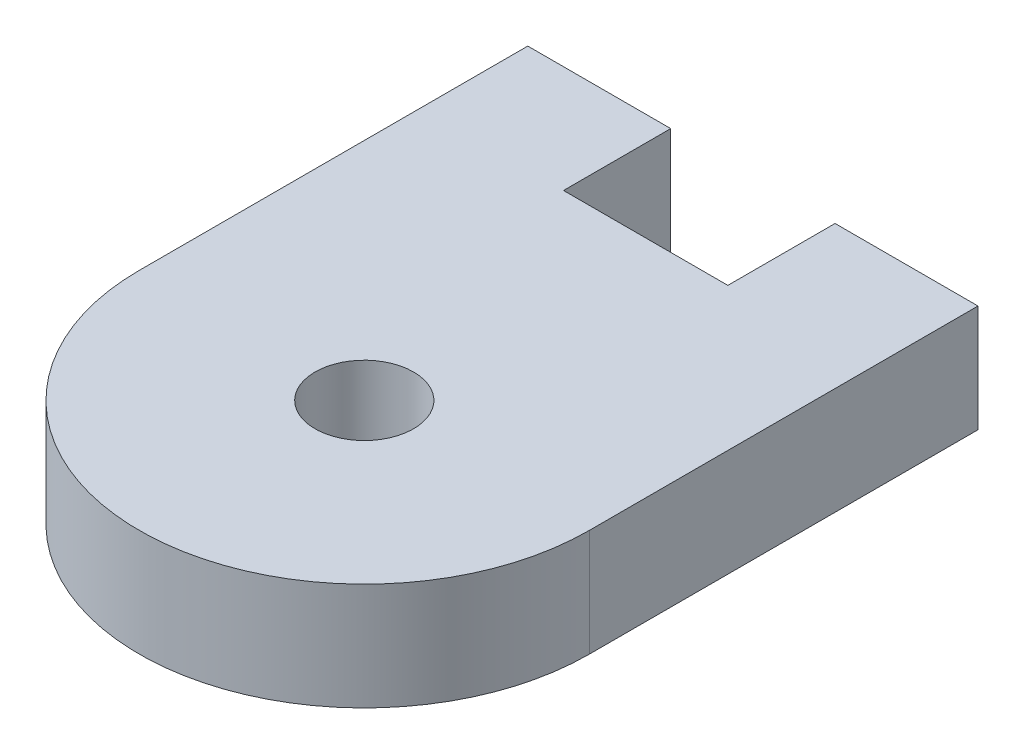
ISO-10303-21;
HEADER;
FILE_DESCRIPTION(('STEP AP214'),'2;1');
FILE_NAME('part.step','',(''),(''),'','','');
FILE_SCHEMA(('AUTOMOTIVE_DESIGN { 1 0 10303 214 1 1 1 1 }'));
ENDSEC;
DATA;
#1=APPLICATION_CONTEXT('core data for automotive mechanical design processes');
#2=APPLICATION_PROTOCOL_DEFINITION('international standard','automotive_design',2000,#1);
#3=PRODUCT_CONTEXT('',#1,'mechanical');
#4=PRODUCT('Part','Part','',(#3));
#5=PRODUCT_RELATED_PRODUCT_CATEGORY('part','',(#4));
#6=PRODUCT_DEFINITION_FORMATION('','',#4);
#7=PRODUCT_DEFINITION_CONTEXT('part definition',#1,'design');
#8=PRODUCT_DEFINITION('design','',#6,#7);
#9=PRODUCT_DEFINITION_SHAPE('','',#8);
#10=(LENGTH_UNIT() NAMED_UNIT(*) SI_UNIT(.MILLI.,.METRE.));
#11=(NAMED_UNIT(*) PLANE_ANGLE_UNIT() SI_UNIT($,.RADIAN.));
#12=(NAMED_UNIT(*) SI_UNIT($,.STERADIAN.) SOLID_ANGLE_UNIT());
#13=UNCERTAINTY_MEASURE_WITH_UNIT(LENGTH_MEASURE(1.E-05),#10,'distance_accuracy_value','');
#14=(GEOMETRIC_REPRESENTATION_CONTEXT(3) GLOBAL_UNCERTAINTY_ASSIGNED_CONTEXT((#13)) GLOBAL_UNIT_ASSIGNED_CONTEXT((#10,
#11,#12)) REPRESENTATION_CONTEXT('',''));
#15=CARTESIAN_POINT('',(0.,0.,0.));
#16=DIRECTION('',(0.,0.,1.));
#17=DIRECTION('',(1.,0.,0.));
#18=AXIS2_PLACEMENT_3D('',#15,#16,#17);
#19=CARTESIAN_POINT('',(0.,7.62,-20.));
#20=DIRECTION('',(0.,0.,-1.));
#21=DIRECTION('',(-1.,0.,0.));
#22=AXIS2_PLACEMENT_3D('',#19,#20,#21);
#23=PLANE('',#22);
#24=DIRECTION('',(1.,0.,0.));
#25=VECTOR('',#24,1.);
#26=CARTESIAN_POINT('',(0.,0.,-20.));
#27=LINE('',#26,#25);
#28=CARTESIAN_POINT('',(10.16,0.,-20.));
#29=VERTEX_POINT('',#28);
#30=CARTESIAN_POINT('',(21.84,0.,-20.));
#31=VERTEX_POINT('',#30);
#32=EDGE_CURVE('E53',#29,#31,#27,.T.);
#33=ORIENTED_EDGE('',*,*,#32,.F.);
#34=DIRECTION('',(0.,-1.,0.));
#35=VECTOR('',#34,1.);
#36=CARTESIAN_POINT('',(10.16,7.62,-20.));
#37=LINE('',#36,#35);
#38=CARTESIAN_POINT('',(10.16,7.62,-20.));
#39=VERTEX_POINT('',#38);
#40=EDGE_CURVE('E122',#39,#29,#37,.T.);
#41=ORIENTED_EDGE('',*,*,#40,.F.);
#42=DIRECTION('',(1.,0.,0.));
#43=VECTOR('',#42,1.);
#44=CARTESIAN_POINT('',(0.,7.62,-20.));
#45=LINE('',#44,#43);
#46=CARTESIAN_POINT('',(21.84,7.62,-20.));
#47=VERTEX_POINT('',#46);
#48=EDGE_CURVE('E108',#39,#47,#45,.T.);
#49=ORIENTED_EDGE('',*,*,#48,.T.);
#50=DIRECTION('',(0.,1.,0.));
#51=VECTOR('',#50,1.);
#52=CARTESIAN_POINT('',(21.84,7.62,-20.));
#53=LINE('',#52,#51);
#54=EDGE_CURVE('E130',#31,#47,#53,.T.);
#55=ORIENTED_EDGE('',*,*,#54,.F.);
#56=EDGE_LOOP('',(#33,#41,#49,#55));
#57=FACE_BOUND('',#56,.T.);
#58=ADVANCED_FACE('F33',(#57),#23,.T.);
#59=CARTESIAN_POINT('',(16.,7.62,0.));
#60=DIRECTION('',(0.,-1.,0.));
#61=DIRECTION('',(0.,0.,-1.));
#62=AXIS2_PLACEMENT_3D('',#59,#60,#61);
#63=CYLINDRICAL_SURFACE('',#62,16.);
#64=CARTESIAN_POINT('',(16.,0.,0.));
#65=DIRECTION('',(0.,1.,0.));
#66=DIRECTION('',(0.,0.,1.));
#67=AXIS2_PLACEMENT_3D('',#64,#65,#66);
#68=CIRCLE('',#67,16.);
#69=CARTESIAN_POINT('',(0.,0.,0.));
#70=VERTEX_POINT('',#69);
#71=CARTESIAN_POINT('',(32.,0.,0.));
#72=VERTEX_POINT('',#71);
#73=EDGE_CURVE('E153',#70,#72,#68,.T.);
#74=ORIENTED_EDGE('',*,*,#73,.T.);
#75=DIRECTION('',(0.,-1.,0.));
#76=VECTOR('',#75,1.);
#77=CARTESIAN_POINT('',(32.,7.62,0.));
#78=LINE('',#77,#76);
#79=CARTESIAN_POINT('',(32.,7.62,0.));
#80=VERTEX_POINT('',#79);
#81=EDGE_CURVE('E11',#80,#72,#78,.T.);
#82=ORIENTED_EDGE('',*,*,#81,.F.);
#83=CARTESIAN_POINT('',(16.,7.62,0.));
#84=DIRECTION('',(0.,1.,0.));
#85=DIRECTION('',(0.,0.,1.));
#86=AXIS2_PLACEMENT_3D('',#83,#84,#85);
#87=CIRCLE('',#86,16.);
#88=CARTESIAN_POINT('',(0.,7.62,0.));
#89=VERTEX_POINT('',#88);
#90=EDGE_CURVE('E156',#89,#80,#87,.T.);
#91=ORIENTED_EDGE('',*,*,#90,.F.);
#92=DIRECTION('',(0.,-1.,0.));
#93=VECTOR('',#92,1.);
#94=CARTESIAN_POINT('',(0.,7.62,0.));
#95=LINE('',#94,#93);
#96=EDGE_CURVE('E41',#89,#70,#95,.T.);
#97=ORIENTED_EDGE('',*,*,#96,.T.);
#98=EDGE_LOOP('',(#74,#82,#91,#97));
#99=FACE_BOUND('',#98,.T.);
#100=ADVANCED_FACE('F35',(#99),#63,.T.);
#101=CARTESIAN_POINT('',(32.,7.62,0.));
#102=DIRECTION('',(-1.,0.,0.));
#103=DIRECTION('',(0.,0.,1.));
#104=AXIS2_PLACEMENT_3D('',#101,#102,#103);
#105=PLANE('',#104);
#106=DIRECTION('',(0.,0.,-1.));
#107=VECTOR('',#106,1.);
#108=CARTESIAN_POINT('',(32.,0.,0.));
#109=LINE('',#108,#107);
#110=CARTESIAN_POINT('',(32.,0.,-27.62));
#111=VERTEX_POINT('',#110);
#112=EDGE_CURVE('E164',#72,#111,#109,.T.);
#113=ORIENTED_EDGE('',*,*,#112,.T.);
#114=DIRECTION('',(0.,-1.,0.));
#115=VECTOR('',#114,1.);
#116=CARTESIAN_POINT('',(32.,7.62,-27.62));
#117=LINE('',#116,#115);
#118=CARTESIAN_POINT('',(32.,7.62,-27.62));
#119=VERTEX_POINT('',#118);
#120=EDGE_CURVE('E131',#119,#111,#117,.T.);
#121=ORIENTED_EDGE('',*,*,#120,.F.);
#122=DIRECTION('',(0.,0.,-1.));
#123=VECTOR('',#122,1.);
#124=CARTESIAN_POINT('',(32.,7.62,0.));
#125=LINE('',#124,#123);
#126=EDGE_CURVE('E158',#80,#119,#125,.T.);
#127=ORIENTED_EDGE('',*,*,#126,.F.);
#128=ORIENTED_EDGE('',*,*,#81,.T.);
#129=EDGE_LOOP('',(#113,#121,#127,#128));
#130=FACE_BOUND('',#129,.T.);
#131=ADVANCED_FACE('F174',(#130),#105,.F.);
#132=CARTESIAN_POINT('',(0.,7.62,0.));
#133=DIRECTION('',(-1.,0.,0.));
#134=DIRECTION('',(0.,0.,1.));
#135=AXIS2_PLACEMENT_3D('',#132,#133,#134);
#136=PLANE('',#135);
#137=DIRECTION('',(0.,0.,-1.));
#138=VECTOR('',#137,1.);
#139=CARTESIAN_POINT('',(0.,0.,0.));
#140=LINE('',#139,#138);
#141=CARTESIAN_POINT('',(0.,0.,-27.62));
#142=VERTEX_POINT('',#141);
#143=EDGE_CURVE('E159',#70,#142,#140,.T.);
#144=ORIENTED_EDGE('',*,*,#143,.F.);
#145=ORIENTED_EDGE('',*,*,#96,.F.);
#146=DIRECTION('',(0.,0.,-1.));
#147=VECTOR('',#146,1.);
#148=CARTESIAN_POINT('',(0.,7.62,0.));
#149=LINE('',#148,#147);
#150=CARTESIAN_POINT('',(0.,7.62,-27.62));
#151=VERTEX_POINT('',#150);
#152=EDGE_CURVE('E99',#89,#151,#149,.T.);
#153=ORIENTED_EDGE('',*,*,#152,.T.);
#154=DIRECTION('',(0.,1.,0.));
#155=VECTOR('',#154,1.);
#156=CARTESIAN_POINT('',(0.,7.62,-27.62));
#157=LINE('',#156,#155);
#158=EDGE_CURVE('E104',#142,#151,#157,.T.);
#159=ORIENTED_EDGE('',*,*,#158,.F.);
#160=EDGE_LOOP('',(#144,#145,#153,#159));
#161=FACE_BOUND('',#160,.T.);
#162=ADVANCED_FACE('F102',(#161),#136,.T.);
#163=CARTESIAN_POINT('',(16.,7.62,0.));
#164=DIRECTION('',(0.,1.,0.));
#165=DIRECTION('',(0.,0.,1.));
#166=AXIS2_PLACEMENT_3D('',#163,#164,#165);
#167=PLANE('',#166);
#168=CARTESIAN_POINT('',(16.,7.62,0.));
#169=DIRECTION('',(0.,-1.,0.));
#170=DIRECTION('',(0.,0.,-1.));
#171=AXIS2_PLACEMENT_3D('',#168,#169,#170);
#172=CIRCLE('',#171,3.5);
#173=CARTESIAN_POINT('',(16.,7.62,-3.5));
#174=VERTEX_POINT('',#173);
#175=EDGE_CURVE('E150',#174,#174,#172,.T.);
#176=ORIENTED_EDGE('',*,*,#175,.T.);
#177=EDGE_LOOP('',(#176));
#178=FACE_BOUND('',#177,.T.);
#179=ORIENTED_EDGE('',*,*,#90,.T.);
#180=ORIENTED_EDGE('',*,*,#126,.T.);
#181=DIRECTION('',(1.,0.,0.));
#182=VECTOR('',#181,1.);
#183=CARTESIAN_POINT('',(32.,7.62,-27.62));
#184=LINE('',#183,#182);
#185=CARTESIAN_POINT('',(21.84,7.62,-27.62));
#186=VERTEX_POINT('',#185);
#187=EDGE_CURVE('E138',#186,#119,#184,.T.);
#188=ORIENTED_EDGE('',*,*,#187,.F.);
#189=DIRECTION('',(0.,0.,1.));
#190=VECTOR('',#189,1.);
#191=CARTESIAN_POINT('',(21.84,7.62,-27.62));
#192=LINE('',#191,#190);
#193=EDGE_CURVE('E141',#186,#47,#192,.T.);
#194=ORIENTED_EDGE('',*,*,#193,.T.);
#195=ORIENTED_EDGE('',*,*,#48,.F.);
#196=DIRECTION('',(0.,0.,1.));
#197=VECTOR('',#196,1.);
#198=CARTESIAN_POINT('',(10.16,7.62,-27.62));
#199=LINE('',#198,#197);
#200=CARTESIAN_POINT('',(10.16,7.62,-27.62));
#201=VERTEX_POINT('',#200);
#202=EDGE_CURVE('E114',#201,#39,#199,.T.);
#203=ORIENTED_EDGE('',*,*,#202,.F.);
#204=DIRECTION('',(1.,0.,0.));
#205=VECTOR('',#204,1.);
#206=CARTESIAN_POINT('',(0.,7.62,-27.62));
#207=LINE('',#206,#205);
#208=EDGE_CURVE('E111',#151,#201,#207,.T.);
#209=ORIENTED_EDGE('',*,*,#208,.F.);
#210=ORIENTED_EDGE('',*,*,#152,.F.);
#211=EDGE_LOOP('',(#179,#180,#188,#194,#195,#203,#209,#210));
#212=FACE_BOUND('',#211,.T.);
#213=ADVANCED_FACE('F112',(#178,#212),#167,.T.);
#214=CARTESIAN_POINT('',(16.,0.,0.));
#215=DIRECTION('',(0.,1.,0.));
#216=DIRECTION('',(0.,0.,1.));
#217=AXIS2_PLACEMENT_3D('',#214,#215,#216);
#218=PLANE('',#217);
#219=CARTESIAN_POINT('',(16.,0.,0.));
#220=DIRECTION('',(0.,-1.,0.));
#221=DIRECTION('',(0.,0.,-1.));
#222=AXIS2_PLACEMENT_3D('',#219,#220,#221);
#223=CIRCLE('',#222,3.5);
#224=CARTESIAN_POINT('',(16.,0.,-3.5));
#225=VERTEX_POINT('',#224);
#226=EDGE_CURVE('E149',#225,#225,#223,.T.);
#227=ORIENTED_EDGE('',*,*,#226,.F.);
#228=EDGE_LOOP('',(#227));
#229=FACE_BOUND('',#228,.T.);
#230=ORIENTED_EDGE('',*,*,#73,.F.);
#231=ORIENTED_EDGE('',*,*,#143,.T.);
#232=DIRECTION('',(-1.,0.,0.));
#233=VECTOR('',#232,1.);
#234=CARTESIAN_POINT('',(0.,0.,-27.62));
#235=LINE('',#234,#233);
#236=CARTESIAN_POINT('',(10.16,0.,-27.62));
#237=VERTEX_POINT('',#236);
#238=EDGE_CURVE('E121',#237,#142,#235,.T.);
#239=ORIENTED_EDGE('',*,*,#238,.F.);
#240=DIRECTION('',(0.,0.,1.));
#241=VECTOR('',#240,1.);
#242=CARTESIAN_POINT('',(10.16,0.,-27.62));
#243=LINE('',#242,#241);
#244=EDGE_CURVE('E48',#237,#29,#243,.T.);
#245=ORIENTED_EDGE('',*,*,#244,.T.);
#246=ORIENTED_EDGE('',*,*,#32,.T.);
#247=DIRECTION('',(0.,0.,1.));
#248=VECTOR('',#247,1.);
#249=CARTESIAN_POINT('',(21.84,0.,-27.62));
#250=LINE('',#249,#248);
#251=CARTESIAN_POINT('',(21.84,0.,-27.62));
#252=VERTEX_POINT('',#251);
#253=EDGE_CURVE('E146',#252,#31,#250,.T.);
#254=ORIENTED_EDGE('',*,*,#253,.F.);
#255=DIRECTION('',(-1.,0.,0.));
#256=VECTOR('',#255,1.);
#257=CARTESIAN_POINT('',(32.,0.,-27.62));
#258=LINE('',#257,#256);
#259=EDGE_CURVE('E134',#111,#252,#258,.T.);
#260=ORIENTED_EDGE('',*,*,#259,.F.);
#261=ORIENTED_EDGE('',*,*,#112,.F.);
#262=EDGE_LOOP('',(#230,#231,#239,#245,#246,#254,#260,#261));
#263=FACE_BOUND('',#262,.T.);
#264=ADVANCED_FACE('F170',(#229,#263),#218,.F.);
#265=CARTESIAN_POINT('',(16.,7.62,0.));
#266=DIRECTION('',(0.,-1.,0.));
#267=DIRECTION('',(0.,0.,-1.));
#268=AXIS2_PLACEMENT_3D('',#265,#266,#267);
#269=CYLINDRICAL_SURFACE('',#268,3.5);
#270=ORIENTED_EDGE('',*,*,#175,.F.);
#271=EDGE_LOOP('',(#270));
#272=FACE_BOUND('',#271,.T.);
#273=ORIENTED_EDGE('',*,*,#226,.T.);
#274=EDGE_LOOP('',(#273));
#275=FACE_BOUND('',#274,.T.);
#276=ADVANCED_FACE('F213',(#272,#275),#269,.F.);
#277=CARTESIAN_POINT('',(21.84,7.62,-27.62));
#278=DIRECTION('',(1.,0.,0.));
#279=DIRECTION('',(0.,0.,-1.));
#280=AXIS2_PLACEMENT_3D('',#277,#278,#279);
#281=PLANE('',#280);
#282=ORIENTED_EDGE('',*,*,#54,.T.);
#283=ORIENTED_EDGE('',*,*,#193,.F.);
#284=DIRECTION('',(0.,1.,0.));
#285=VECTOR('',#284,1.);
#286=CARTESIAN_POINT('',(21.84,7.62,-27.62));
#287=LINE('',#286,#285);
#288=EDGE_CURVE('E136',#252,#186,#287,.T.);
#289=ORIENTED_EDGE('',*,*,#288,.F.);
#290=ORIENTED_EDGE('',*,*,#253,.T.);
#291=EDGE_LOOP('',(#282,#283,#289,#290));
#292=FACE_BOUND('',#291,.T.);
#293=ADVANCED_FACE('F181',(#292),#281,.F.);
#294=CARTESIAN_POINT('',(0.,0.,-27.62));
#295=DIRECTION('',(0.,0.,-1.));
#296=DIRECTION('',(-1.,0.,0.));
#297=AXIS2_PLACEMENT_3D('',#294,#295,#296);
#298=PLANE('',#297);
#299=ORIENTED_EDGE('',*,*,#120,.T.);
#300=ORIENTED_EDGE('',*,*,#259,.T.);
#301=ORIENTED_EDGE('',*,*,#288,.T.);
#302=ORIENTED_EDGE('',*,*,#187,.T.);
#303=EDGE_LOOP('',(#299,#300,#301,#302));
#304=FACE_BOUND('',#303,.T.);
#305=ADVANCED_FACE('F177',(#304),#298,.T.);
#306=CARTESIAN_POINT('',(10.16,7.62,-27.62));
#307=DIRECTION('',(-1.,0.,0.));
#308=DIRECTION('',(0.,0.,1.));
#309=AXIS2_PLACEMENT_3D('',#306,#307,#308);
#310=PLANE('',#309);
#311=ORIENTED_EDGE('',*,*,#40,.T.);
#312=ORIENTED_EDGE('',*,*,#244,.F.);
#313=DIRECTION('',(0.,-1.,0.));
#314=VECTOR('',#313,1.);
#315=CARTESIAN_POINT('',(10.16,7.62,-27.62));
#316=LINE('',#315,#314);
#317=EDGE_CURVE('E117',#201,#237,#316,.T.);
#318=ORIENTED_EDGE('',*,*,#317,.F.);
#319=ORIENTED_EDGE('',*,*,#202,.T.);
#320=EDGE_LOOP('',(#311,#312,#318,#319));
#321=FACE_BOUND('',#320,.T.);
#322=ADVANCED_FACE('F185',(#321),#310,.F.);
#323=CARTESIAN_POINT('',(0.,0.,-27.62));
#324=DIRECTION('',(0.,0.,1.));
#325=DIRECTION('',(1.,0.,0.));
#326=AXIS2_PLACEMENT_3D('',#323,#324,#325);
#327=PLANE('',#326);
#328=ORIENTED_EDGE('',*,*,#158,.T.);
#329=ORIENTED_EDGE('',*,*,#208,.T.);
#330=ORIENTED_EDGE('',*,*,#317,.T.);
#331=ORIENTED_EDGE('',*,*,#238,.T.);
#332=EDGE_LOOP('',(#328,#329,#330,#331));
#333=FACE_BOUND('',#332,.T.);
#334=ADVANCED_FACE('F120',(#333),#327,.F.);
#335=CLOSED_SHELL('',(#58,#100,#131,#162,#213,#264,#276,#293,#305,#322,#334));
#336=MANIFOLD_SOLID_BREP('B2',#335);
#337=ADVANCED_BREP_SHAPE_REPRESENTATION('',(#18,#336),#14);
#338=SHAPE_DEFINITION_REPRESENTATION(#9,#337);
ENDSEC;
END-ISO-10303-21;
